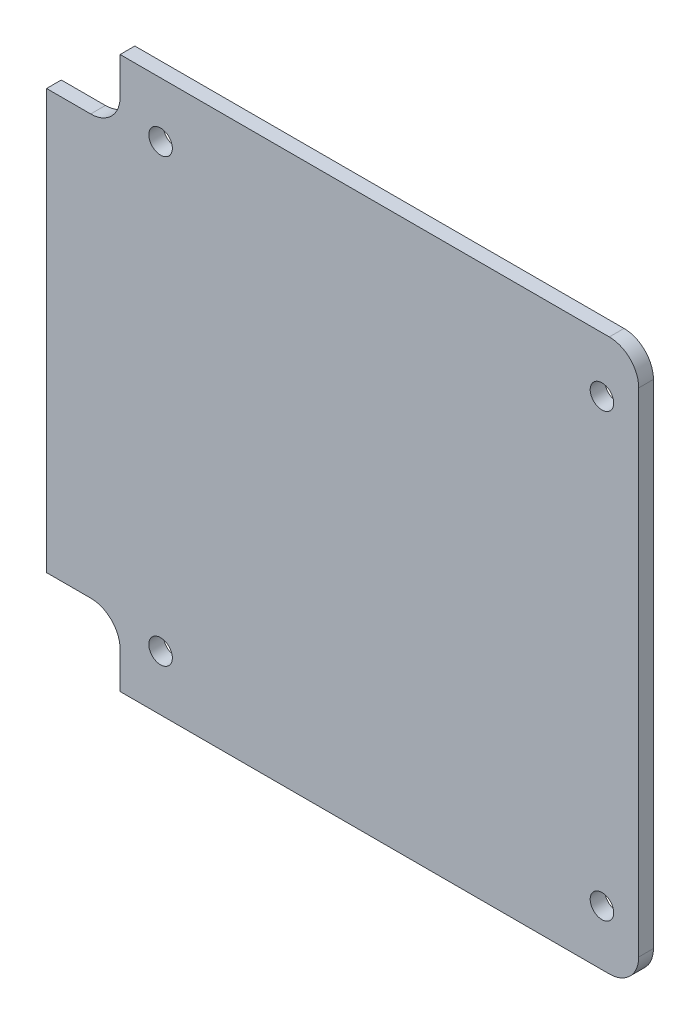
ISO-10303-21;
HEADER;
FILE_DESCRIPTION(('STEP AP214'),'2;1');
FILE_NAME('part.step','',(''),(''),'','','');
FILE_SCHEMA(('AUTOMOTIVE_DESIGN { 1 0 10303 214 1 1 1 1 }'));
ENDSEC;
DATA;
#1=APPLICATION_CONTEXT('core data for automotive mechanical design processes');
#2=APPLICATION_PROTOCOL_DEFINITION('international standard','automotive_design',2000,#1);
#3=PRODUCT_CONTEXT('',#1,'mechanical');
#4=PRODUCT('Part','Part','',(#3));
#5=PRODUCT_RELATED_PRODUCT_CATEGORY('part','',(#4));
#6=PRODUCT_DEFINITION_FORMATION('','',#4);
#7=PRODUCT_DEFINITION_CONTEXT('part definition',#1,'design');
#8=PRODUCT_DEFINITION('design','',#6,#7);
#9=PRODUCT_DEFINITION_SHAPE('','',#8);
#10=(LENGTH_UNIT() NAMED_UNIT(*) SI_UNIT(.MILLI.,.METRE.));
#11=(NAMED_UNIT(*) PLANE_ANGLE_UNIT() SI_UNIT($,.RADIAN.));
#12=(NAMED_UNIT(*) SI_UNIT($,.STERADIAN.) SOLID_ANGLE_UNIT());
#13=UNCERTAINTY_MEASURE_WITH_UNIT(LENGTH_MEASURE(1.E-05),#10,'distance_accuracy_value','');
#14=(GEOMETRIC_REPRESENTATION_CONTEXT(3) GLOBAL_UNCERTAINTY_ASSIGNED_CONTEXT((#13)) GLOBAL_UNIT_ASSIGNED_CONTEXT((#10,
#11,#12)) REPRESENTATION_CONTEXT('',''));
#15=CARTESIAN_POINT('',(0.,0.,0.));
#16=DIRECTION('',(0.,0.,1.));
#17=DIRECTION('',(1.,0.,0.));
#18=AXIS2_PLACEMENT_3D('',#15,#16,#17);
#19=CARTESIAN_POINT('',(-30.25,0.,2.));
#20=DIRECTION('',(-1.,0.,0.));
#21=DIRECTION('',(0.,0.,1.));
#22=AXIS2_PLACEMENT_3D('',#19,#20,#21);
#23=PLANE('',#22);
#24=DIRECTION('',(0.,1.,0.));
#25=VECTOR('',#24,1.);
#26=CARTESIAN_POINT('',(-30.25,0.,2.));
#27=LINE('',#26,#25);
#28=CARTESIAN_POINT('',(-30.25,-37.5,2.));
#29=VERTEX_POINT('',#28);
#30=CARTESIAN_POINT('',(-30.25,-32.5,2.));
#31=VERTEX_POINT('',#30);
#32=EDGE_CURVE('E127',#29,#31,#27,.T.);
#33=ORIENTED_EDGE('',*,*,#32,.T.);
#34=DIRECTION('',(0.,0.,-1.));
#35=VECTOR('',#34,1.);
#36=CARTESIAN_POINT('',(-30.25,-32.5,2.));
#37=LINE('',#36,#35);
#38=CARTESIAN_POINT('',(-30.25,-32.5,0.));
#39=VERTEX_POINT('',#38);
#40=EDGE_CURVE('E225',#31,#39,#37,.T.);
#41=ORIENTED_EDGE('',*,*,#40,.T.);
#42=DIRECTION('',(0.,1.,0.));
#43=VECTOR('',#42,1.);
#44=CARTESIAN_POINT('',(-30.25,0.,0.));
#45=LINE('',#44,#43);
#46=CARTESIAN_POINT('',(-30.25,-37.5,0.));
#47=VERTEX_POINT('',#46);
#48=EDGE_CURVE('E130',#47,#39,#45,.T.);
#49=ORIENTED_EDGE('',*,*,#48,.F.);
#50=DIRECTION('',(0.,0.,-1.));
#51=VECTOR('',#50,1.);
#52=CARTESIAN_POINT('',(-30.25,-37.5,2.));
#53=LINE('',#52,#51);
#54=EDGE_CURVE('E123',#29,#47,#53,.T.);
#55=ORIENTED_EDGE('',*,*,#54,.F.);
#56=EDGE_LOOP('',(#33,#41,#49,#55));
#57=FACE_BOUND('',#56,.T.);
#58=ADVANCED_FACE('F33',(#57),#23,.T.);
#59=CARTESIAN_POINT('',(0.,-37.5,2.));
#60=DIRECTION('',(0.,1.,0.));
#61=DIRECTION('',(0.,0.,1.));
#62=AXIS2_PLACEMENT_3D('',#59,#60,#61);
#63=PLANE('',#62);
#64=DIRECTION('',(1.,0.,0.));
#65=VECTOR('',#64,1.);
#66=CARTESIAN_POINT('',(0.,-37.5,0.));
#67=LINE('',#66,#65);
#68=CARTESIAN_POINT('',(36.25,-37.5,0.));
#69=VERTEX_POINT('',#68);
#70=EDGE_CURVE('E184',#47,#69,#67,.T.);
#71=ORIENTED_EDGE('',*,*,#70,.T.);
#72=DIRECTION('',(0.,0.,-1.));
#73=VECTOR('',#72,1.);
#74=CARTESIAN_POINT('',(36.25,-37.5,2.));
#75=LINE('',#74,#73);
#76=CARTESIAN_POINT('',(36.25,-37.5,2.));
#77=VERTEX_POINT('',#76);
#78=EDGE_CURVE('E141',#69,#77,#75,.F.);
#79=ORIENTED_EDGE('',*,*,#78,.T.);
#80=DIRECTION('',(1.,0.,0.));
#81=VECTOR('',#80,1.);
#82=CARTESIAN_POINT('',(0.,-37.5,2.));
#83=LINE('',#82,#81);
#84=EDGE_CURVE('E138',#29,#77,#83,.T.);
#85=ORIENTED_EDGE('',*,*,#84,.F.);
#86=ORIENTED_EDGE('',*,*,#54,.T.);
#87=EDGE_LOOP('',(#71,#79,#85,#86));
#88=FACE_BOUND('',#87,.T.);
#89=ADVANCED_FACE('F139',(#88),#63,.F.);
#90=CARTESIAN_POINT('',(40.25,0.,2.));
#91=DIRECTION('',(1.,0.,0.));
#92=DIRECTION('',(0.,1.,0.));
#93=AXIS2_PLACEMENT_3D('',#90,#91,#92);
#94=PLANE('',#93);
#95=DIRECTION('',(0.,-1.,0.));
#96=VECTOR('',#95,1.);
#97=CARTESIAN_POINT('',(40.25,0.,0.));
#98=LINE('',#97,#96);
#99=CARTESIAN_POINT('',(40.25,33.5,0.));
#100=VERTEX_POINT('',#99);
#101=CARTESIAN_POINT('',(40.25,-33.5,0.));
#102=VERTEX_POINT('',#101);
#103=EDGE_CURVE('E186',#100,#102,#98,.T.);
#104=ORIENTED_EDGE('',*,*,#103,.F.);
#105=DIRECTION('',(0.,0.,-1.));
#106=VECTOR('',#105,1.);
#107=CARTESIAN_POINT('',(40.25,33.5,2.));
#108=LINE('',#107,#106);
#109=CARTESIAN_POINT('',(40.25,33.5,2.));
#110=VERTEX_POINT('',#109);
#111=EDGE_CURVE('E218',#100,#110,#108,.F.);
#112=ORIENTED_EDGE('',*,*,#111,.T.);
#113=DIRECTION('',(0.,-1.,0.));
#114=VECTOR('',#113,1.);
#115=CARTESIAN_POINT('',(40.25,0.,2.));
#116=LINE('',#115,#114);
#117=CARTESIAN_POINT('',(40.25,-33.5,2.));
#118=VERTEX_POINT('',#117);
#119=EDGE_CURVE('E143',#110,#118,#116,.T.);
#120=ORIENTED_EDGE('',*,*,#119,.T.);
#121=DIRECTION('',(0.,0.,-1.));
#122=VECTOR('',#121,1.);
#123=CARTESIAN_POINT('',(40.25,-33.5,0.));
#124=LINE('',#123,#122);
#125=EDGE_CURVE('E215',#118,#102,#124,.T.);
#126=ORIENTED_EDGE('',*,*,#125,.T.);
#127=EDGE_LOOP('',(#104,#112,#120,#126));
#128=FACE_BOUND('',#127,.T.);
#129=ADVANCED_FACE('F262',(#128),#94,.T.);
#130=CARTESIAN_POINT('',(0.,37.5,2.));
#131=DIRECTION('',(0.,1.,0.));
#132=DIRECTION('',(0.,0.,1.));
#133=AXIS2_PLACEMENT_3D('',#130,#131,#132);
#134=PLANE('',#133);
#135=DIRECTION('',(1.,0.,0.));
#136=VECTOR('',#135,1.);
#137=CARTESIAN_POINT('',(0.,37.5,2.));
#138=LINE('',#137,#136);
#139=CARTESIAN_POINT('',(-30.25,37.5,2.));
#140=VERTEX_POINT('',#139);
#141=CARTESIAN_POINT('',(36.25,37.5,2.));
#142=VERTEX_POINT('',#141);
#143=EDGE_CURVE('E158',#140,#142,#138,.T.);
#144=ORIENTED_EDGE('',*,*,#143,.T.);
#145=DIRECTION('',(0.,0.,-1.));
#146=VECTOR('',#145,1.);
#147=CARTESIAN_POINT('',(36.25,37.5,2.));
#148=LINE('',#147,#146);
#149=CARTESIAN_POINT('',(36.25,37.5,0.));
#150=VERTEX_POINT('',#149);
#151=EDGE_CURVE('E134',#142,#150,#148,.T.);
#152=ORIENTED_EDGE('',*,*,#151,.T.);
#153=DIRECTION('',(1.,0.,0.));
#154=VECTOR('',#153,1.);
#155=CARTESIAN_POINT('',(0.,37.5,0.));
#156=LINE('',#155,#154);
#157=CARTESIAN_POINT('',(-30.25,37.5,0.));
#158=VERTEX_POINT('',#157);
#159=EDGE_CURVE('E189',#158,#150,#156,.T.);
#160=ORIENTED_EDGE('',*,*,#159,.F.);
#161=DIRECTION('',(0.,0.,-1.));
#162=VECTOR('',#161,1.);
#163=CARTESIAN_POINT('',(-30.25,37.5,2.));
#164=LINE('',#163,#162);
#165=EDGE_CURVE('E135',#140,#158,#164,.T.);
#166=ORIENTED_EDGE('',*,*,#165,.F.);
#167=EDGE_LOOP('',(#144,#152,#160,#166));
#168=FACE_BOUND('',#167,.T.);
#169=ADVANCED_FACE('F269',(#168),#134,.T.);
#170=CARTESIAN_POINT('',(-30.25,0.,2.));
#171=DIRECTION('',(1.,0.,0.));
#172=DIRECTION('',(0.,1.,0.));
#173=AXIS2_PLACEMENT_3D('',#170,#171,#172);
#174=PLANE('',#173);
#175=DIRECTION('',(0.,-1.,0.));
#176=VECTOR('',#175,1.);
#177=CARTESIAN_POINT('',(-30.25,0.,0.));
#178=LINE('',#177,#176);
#179=CARTESIAN_POINT('',(-30.25,32.5,0.));
#180=VERTEX_POINT('',#179);
#181=EDGE_CURVE('E192',#158,#180,#178,.T.);
#182=ORIENTED_EDGE('',*,*,#181,.T.);
#183=DIRECTION('',(0.,0.,-1.));
#184=VECTOR('',#183,1.);
#185=CARTESIAN_POINT('',(-30.25,32.5,2.));
#186=LINE('',#185,#184);
#187=CARTESIAN_POINT('',(-30.25,32.5,2.));
#188=VERTEX_POINT('',#187);
#189=EDGE_CURVE('E231',#180,#188,#186,.F.);
#190=ORIENTED_EDGE('',*,*,#189,.T.);
#191=DIRECTION('',(0.,-1.,0.));
#192=VECTOR('',#191,1.);
#193=CARTESIAN_POINT('',(-30.25,0.,2.));
#194=LINE('',#193,#192);
#195=EDGE_CURVE('E161',#140,#188,#194,.T.);
#196=ORIENTED_EDGE('',*,*,#195,.F.);
#197=ORIENTED_EDGE('',*,*,#165,.T.);
#198=EDGE_LOOP('',(#182,#190,#196,#197));
#199=FACE_BOUND('',#198,.T.);
#200=ADVANCED_FACE('F245',(#199),#174,.F.);
#201=CARTESIAN_POINT('',(0.,28.5,2.));
#202=DIRECTION('',(0.,1.,0.));
#203=DIRECTION('',(0.,0.,1.));
#204=AXIS2_PLACEMENT_3D('',#201,#202,#203);
#205=PLANE('',#204);
#206=DIRECTION('',(1.,0.,0.));
#207=VECTOR('',#206,1.);
#208=CARTESIAN_POINT('',(0.,28.5,2.));
#209=LINE('',#208,#207);
#210=CARTESIAN_POINT('',(-40.25,28.5,2.));
#211=VERTEX_POINT('',#210);
#212=CARTESIAN_POINT('',(-34.25,28.5,2.));
#213=VERTEX_POINT('',#212);
#214=EDGE_CURVE('E163',#211,#213,#209,.T.);
#215=ORIENTED_EDGE('',*,*,#214,.T.);
#216=DIRECTION('',(0.,0.,-1.));
#217=VECTOR('',#216,1.);
#218=CARTESIAN_POINT('',(-34.25,28.5,2.));
#219=LINE('',#218,#217);
#220=CARTESIAN_POINT('',(-34.25,28.5,0.));
#221=VERTEX_POINT('',#220);
#222=EDGE_CURVE('E228',#213,#221,#219,.T.);
#223=ORIENTED_EDGE('',*,*,#222,.T.);
#224=DIRECTION('',(1.,0.,0.));
#225=VECTOR('',#224,1.);
#226=CARTESIAN_POINT('',(0.,28.5,0.));
#227=LINE('',#226,#225);
#228=CARTESIAN_POINT('',(-40.25,28.5,0.));
#229=VERTEX_POINT('',#228);
#230=EDGE_CURVE('E195',#229,#221,#227,.T.);
#231=ORIENTED_EDGE('',*,*,#230,.F.);
#232=DIRECTION('',(0.,0.,-1.));
#233=VECTOR('',#232,1.);
#234=CARTESIAN_POINT('',(-40.25,28.5,2.));
#235=LINE('',#234,#233);
#236=EDGE_CURVE('E206',#211,#229,#235,.T.);
#237=ORIENTED_EDGE('',*,*,#236,.F.);
#238=EDGE_LOOP('',(#215,#223,#231,#237));
#239=FACE_BOUND('',#238,.T.);
#240=ADVANCED_FACE('F248',(#239),#205,.T.);
#241=CARTESIAN_POINT('',(-40.25,0.,2.));
#242=DIRECTION('',(1.,0.,0.));
#243=DIRECTION('',(0.,1.,0.));
#244=AXIS2_PLACEMENT_3D('',#241,#242,#243);
#245=PLANE('',#244);
#246=DIRECTION('',(0.,-1.,0.));
#247=VECTOR('',#246,1.);
#248=CARTESIAN_POINT('',(-40.25,0.,0.));
#249=LINE('',#248,#247);
#250=CARTESIAN_POINT('',(-40.25,-28.5,0.));
#251=VERTEX_POINT('',#250);
#252=EDGE_CURVE('E198',#229,#251,#249,.T.);
#253=ORIENTED_EDGE('',*,*,#252,.T.);
#254=DIRECTION('',(0.,0.,-1.));
#255=VECTOR('',#254,1.);
#256=CARTESIAN_POINT('',(-40.25,-28.5,2.));
#257=LINE('',#256,#255);
#258=CARTESIAN_POINT('',(-40.25,-28.5,2.));
#259=VERTEX_POINT('',#258);
#260=EDGE_CURVE('E170',#259,#251,#257,.T.);
#261=ORIENTED_EDGE('',*,*,#260,.F.);
#262=DIRECTION('',(0.,-1.,0.));
#263=VECTOR('',#262,1.);
#264=CARTESIAN_POINT('',(-40.25,0.,2.));
#265=LINE('',#264,#263);
#266=EDGE_CURVE('E165',#211,#259,#265,.T.);
#267=ORIENTED_EDGE('',*,*,#266,.F.);
#268=ORIENTED_EDGE('',*,*,#236,.T.);
#269=EDGE_LOOP('',(#253,#261,#267,#268));
#270=FACE_BOUND('',#269,.T.);
#271=ADVANCED_FACE('F252',(#270),#245,.F.);
#272=CARTESIAN_POINT('',(35.25,-30.,2.));
#273=DIRECTION('',(0.,0.,-1.));
#274=DIRECTION('',(-1.,0.,0.));
#275=AXIS2_PLACEMENT_3D('',#272,#273,#274);
#276=CYLINDRICAL_SURFACE('',#275,1.6);
#277=CARTESIAN_POINT('',(35.25,-30.,2.));
#278=DIRECTION('',(0.,0.,1.));
#279=DIRECTION('',(1.,0.,0.));
#280=AXIS2_PLACEMENT_3D('',#277,#278,#279);
#281=CIRCLE('',#280,1.6);
#282=CARTESIAN_POINT('',(36.85,-30.,2.));
#283=VERTEX_POINT('',#282);
#284=EDGE_CURVE('E149',#283,#283,#281,.T.);
#285=ORIENTED_EDGE('',*,*,#284,.T.);
#286=EDGE_LOOP('',(#285));
#287=FACE_BOUND('',#286,.T.);
#288=CARTESIAN_POINT('',(35.25,-30.,0.));
#289=DIRECTION('',(0.,0.,1.));
#290=DIRECTION('',(1.,0.,0.));
#291=AXIS2_PLACEMENT_3D('',#288,#289,#290);
#292=CIRCLE('',#291,1.6);
#293=CARTESIAN_POINT('',(36.85,-30.,0.));
#294=VERTEX_POINT('',#293);
#295=EDGE_CURVE('E180',#294,#294,#292,.T.);
#296=ORIENTED_EDGE('',*,*,#295,.F.);
#297=EDGE_LOOP('',(#296));
#298=FACE_BOUND('',#297,.T.);
#299=ADVANCED_FACE('F285',(#287,#298),#276,.F.);
#300=CARTESIAN_POINT('',(35.25,30.,2.));
#301=DIRECTION('',(0.,0.,-1.));
#302=DIRECTION('',(-1.,0.,0.));
#303=AXIS2_PLACEMENT_3D('',#300,#301,#302);
#304=CYLINDRICAL_SURFACE('',#303,1.6);
#305=CARTESIAN_POINT('',(35.25,30.,2.));
#306=DIRECTION('',(0.,0.,1.));
#307=DIRECTION('',(1.,0.,0.));
#308=AXIS2_PLACEMENT_3D('',#305,#306,#307);
#309=CIRCLE('',#308,1.6);
#310=CARTESIAN_POINT('',(36.85,30.,2.));
#311=VERTEX_POINT('',#310);
#312=EDGE_CURVE('E152',#311,#311,#309,.T.);
#313=ORIENTED_EDGE('',*,*,#312,.T.);
#314=EDGE_LOOP('',(#313));
#315=FACE_BOUND('',#314,.T.);
#316=CARTESIAN_POINT('',(35.25,30.,0.));
#317=DIRECTION('',(0.,0.,1.));
#318=DIRECTION('',(1.,0.,0.));
#319=AXIS2_PLACEMENT_3D('',#316,#317,#318);
#320=CIRCLE('',#319,1.6);
#321=CARTESIAN_POINT('',(36.85,30.,0.));
#322=VERTEX_POINT('',#321);
#323=EDGE_CURVE('E177',#322,#322,#320,.T.);
#324=ORIENTED_EDGE('',*,*,#323,.F.);
#325=EDGE_LOOP('',(#324));
#326=FACE_BOUND('',#325,.T.);
#327=ADVANCED_FACE('F288',(#315,#326),#304,.F.);
#328=CARTESIAN_POINT('',(-24.75,30.,2.));
#329=DIRECTION('',(0.,0.,-1.));
#330=DIRECTION('',(-1.,0.,0.));
#331=AXIS2_PLACEMENT_3D('',#328,#329,#330);
#332=CYLINDRICAL_SURFACE('',#331,1.6);
#333=CARTESIAN_POINT('',(-24.75,30.,2.));
#334=DIRECTION('',(0.,0.,1.));
#335=DIRECTION('',(1.,0.,0.));
#336=AXIS2_PLACEMENT_3D('',#333,#334,#335);
#337=CIRCLE('',#336,1.6);
#338=CARTESIAN_POINT('',(-23.15,30.,2.));
#339=VERTEX_POINT('',#338);
#340=EDGE_CURVE('E428',#339,#339,#337,.T.);
#341=ORIENTED_EDGE('',*,*,#340,.T.);
#342=EDGE_LOOP('',(#341));
#343=FACE_BOUND('',#342,.T.);
#344=CARTESIAN_POINT('',(-24.75,30.,0.));
#345=DIRECTION('',(0.,0.,1.));
#346=DIRECTION('',(1.,0.,0.));
#347=AXIS2_PLACEMENT_3D('',#344,#345,#346);
#348=CIRCLE('',#347,1.6);
#349=CARTESIAN_POINT('',(-23.15,30.,0.));
#350=VERTEX_POINT('',#349);
#351=EDGE_CURVE('E174',#350,#350,#348,.T.);
#352=ORIENTED_EDGE('',*,*,#351,.F.);
#353=EDGE_LOOP('',(#352));
#354=FACE_BOUND('',#353,.T.);
#355=ADVANCED_FACE('F292',(#343,#354),#332,.F.);
#356=CARTESIAN_POINT('',(-24.75,-30.,2.));
#357=DIRECTION('',(0.,0.,-1.));
#358=DIRECTION('',(-1.,0.,0.));
#359=AXIS2_PLACEMENT_3D('',#356,#357,#358);
#360=CYLINDRICAL_SURFACE('',#359,1.6);
#361=CARTESIAN_POINT('',(-24.75,-30.,2.));
#362=DIRECTION('',(0.,0.,1.));
#363=DIRECTION('',(1.,0.,0.));
#364=AXIS2_PLACEMENT_3D('',#361,#362,#363);
#365=CIRCLE('',#364,1.6);
#366=CARTESIAN_POINT('',(-23.15,-30.,2.));
#367=VERTEX_POINT('',#366);
#368=EDGE_CURVE('E203',#367,#367,#365,.T.);
#369=ORIENTED_EDGE('',*,*,#368,.T.);
#370=EDGE_LOOP('',(#369));
#371=FACE_BOUND('',#370,.T.);
#372=CARTESIAN_POINT('',(-24.75,-30.,0.));
#373=DIRECTION('',(0.,0.,1.));
#374=DIRECTION('',(1.,0.,0.));
#375=AXIS2_PLACEMENT_3D('',#372,#373,#374);
#376=CIRCLE('',#375,1.6);
#377=CARTESIAN_POINT('',(-23.15,-30.,0.));
#378=VERTEX_POINT('',#377);
#379=EDGE_CURVE('E171',#378,#378,#376,.T.);
#380=ORIENTED_EDGE('',*,*,#379,.F.);
#381=EDGE_LOOP('',(#380));
#382=FACE_BOUND('',#381,.T.);
#383=ADVANCED_FACE('F296',(#371,#382),#360,.F.);
#384=CARTESIAN_POINT('',(0.,-28.5,2.));
#385=DIRECTION('',(0.,1.,0.));
#386=DIRECTION('',(0.,0.,1.));
#387=AXIS2_PLACEMENT_3D('',#384,#385,#386);
#388=PLANE('',#387);
#389=DIRECTION('',(1.,0.,0.));
#390=VECTOR('',#389,1.);
#391=CARTESIAN_POINT('',(0.,-28.5,0.));
#392=LINE('',#391,#390);
#393=CARTESIAN_POINT('',(-34.25,-28.5,0.));
#394=VERTEX_POINT('',#393);
#395=EDGE_CURVE('E201',#251,#394,#392,.T.);
#396=ORIENTED_EDGE('',*,*,#395,.T.);
#397=DIRECTION('',(0.,0.,-1.));
#398=VECTOR('',#397,1.);
#399=CARTESIAN_POINT('',(-34.25,-28.5,2.));
#400=LINE('',#399,#398);
#401=CARTESIAN_POINT('',(-34.25,-28.5,2.));
#402=VERTEX_POINT('',#401);
#403=EDGE_CURVE('E48',#394,#402,#400,.F.);
#404=ORIENTED_EDGE('',*,*,#403,.T.);
#405=DIRECTION('',(1.,0.,0.));
#406=VECTOR('',#405,1.);
#407=CARTESIAN_POINT('',(0.,-28.5,2.));
#408=LINE('',#407,#406);
#409=EDGE_CURVE('E168',#259,#402,#408,.T.);
#410=ORIENTED_EDGE('',*,*,#409,.F.);
#411=ORIENTED_EDGE('',*,*,#260,.T.);
#412=EDGE_LOOP('',(#396,#404,#410,#411));
#413=FACE_BOUND('',#412,.T.);
#414=ADVANCED_FACE('F253',(#413),#388,.F.);
#415=CARTESIAN_POINT('',(0.,0.,2.));
#416=DIRECTION('',(0.,0.,1.));
#417=DIRECTION('',(1.,0.,0.));
#418=AXIS2_PLACEMENT_3D('',#415,#416,#417);
#419=PLANE('',#418);
#420=ORIENTED_EDGE('',*,*,#368,.F.);
#421=EDGE_LOOP('',(#420));
#422=FACE_BOUND('',#421,.T.);
#423=ORIENTED_EDGE('',*,*,#340,.F.);
#424=EDGE_LOOP('',(#423));
#425=FACE_BOUND('',#424,.T.);
#426=ORIENTED_EDGE('',*,*,#312,.F.);
#427=EDGE_LOOP('',(#426));
#428=FACE_BOUND('',#427,.T.);
#429=ORIENTED_EDGE('',*,*,#284,.F.);
#430=EDGE_LOOP('',(#429));
#431=FACE_BOUND('',#430,.T.);
#432=ORIENTED_EDGE('',*,*,#119,.F.);
#433=CARTESIAN_POINT('',(36.25,33.5,2.));
#434=DIRECTION('',(0.,0.,1.));
#435=DIRECTION('',(1.,0.,0.));
#436=AXIS2_PLACEMENT_3D('',#433,#434,#435);
#437=CIRCLE('',#436,4.);
#438=EDGE_CURVE('E222',#110,#142,#437,.T.);
#439=ORIENTED_EDGE('',*,*,#438,.T.);
#440=ORIENTED_EDGE('',*,*,#143,.F.);
#441=ORIENTED_EDGE('',*,*,#195,.T.);
#442=CARTESIAN_POINT('',(-34.25,32.5,2.));
#443=DIRECTION('',(0.,0.,1.));
#444=DIRECTION('',(1.,0.,0.));
#445=AXIS2_PLACEMENT_3D('',#442,#443,#444);
#446=CIRCLE('',#445,4.);
#447=EDGE_CURVE('E11',#188,#213,#446,.F.);
#448=ORIENTED_EDGE('',*,*,#447,.T.);
#449=ORIENTED_EDGE('',*,*,#214,.F.);
#450=ORIENTED_EDGE('',*,*,#266,.T.);
#451=ORIENTED_EDGE('',*,*,#409,.T.);
#452=CARTESIAN_POINT('',(-34.25,-32.5,2.));
#453=DIRECTION('',(0.,0.,1.));
#454=DIRECTION('',(1.,0.,0.));
#455=AXIS2_PLACEMENT_3D('',#452,#453,#454);
#456=CIRCLE('',#455,4.);
#457=EDGE_CURVE('E148',#402,#31,#456,.F.);
#458=ORIENTED_EDGE('',*,*,#457,.T.);
#459=ORIENTED_EDGE('',*,*,#32,.F.);
#460=ORIENTED_EDGE('',*,*,#84,.T.);
#461=CARTESIAN_POINT('',(36.25,-33.5,2.));
#462=DIRECTION('',(0.,0.,1.));
#463=DIRECTION('',(1.,0.,0.));
#464=AXIS2_PLACEMENT_3D('',#461,#462,#463);
#465=CIRCLE('',#464,4.);
#466=EDGE_CURVE('E220',#77,#118,#465,.T.);
#467=ORIENTED_EDGE('',*,*,#466,.T.);
#468=EDGE_LOOP('',(#432,#439,#440,#441,#448,#449,#450,#451,#458,#459,#460,#467));
#469=FACE_BOUND('',#468,.T.);
#470=ADVANCED_FACE('F146',(#422,#425,#428,#431,#469),#419,.T.);
#471=CARTESIAN_POINT('',(0.,0.,0.));
#472=DIRECTION('',(0.,0.,1.));
#473=DIRECTION('',(1.,0.,0.));
#474=AXIS2_PLACEMENT_3D('',#471,#472,#473);
#475=PLANE('',#474);
#476=ORIENTED_EDGE('',*,*,#379,.T.);
#477=EDGE_LOOP('',(#476));
#478=FACE_BOUND('',#477,.T.);
#479=ORIENTED_EDGE('',*,*,#351,.T.);
#480=EDGE_LOOP('',(#479));
#481=FACE_BOUND('',#480,.T.);
#482=ORIENTED_EDGE('',*,*,#323,.T.);
#483=EDGE_LOOP('',(#482));
#484=FACE_BOUND('',#483,.T.);
#485=ORIENTED_EDGE('',*,*,#295,.T.);
#486=EDGE_LOOP('',(#485));
#487=FACE_BOUND('',#486,.T.);
#488=ORIENTED_EDGE('',*,*,#159,.T.);
#489=CARTESIAN_POINT('',(36.25,33.5,0.));
#490=DIRECTION('',(0.,0.,1.));
#491=DIRECTION('',(1.,0.,0.));
#492=AXIS2_PLACEMENT_3D('',#489,#490,#491);
#493=CIRCLE('',#492,4.);
#494=EDGE_CURVE('E213',#150,#100,#493,.F.);
#495=ORIENTED_EDGE('',*,*,#494,.T.);
#496=ORIENTED_EDGE('',*,*,#103,.T.);
#497=CARTESIAN_POINT('',(36.25,-33.5,0.));
#498=DIRECTION('',(0.,0.,1.));
#499=DIRECTION('',(1.,0.,0.));
#500=AXIS2_PLACEMENT_3D('',#497,#498,#499);
#501=CIRCLE('',#500,4.);
#502=EDGE_CURVE('E211',#102,#69,#501,.F.);
#503=ORIENTED_EDGE('',*,*,#502,.T.);
#504=ORIENTED_EDGE('',*,*,#70,.F.);
#505=ORIENTED_EDGE('',*,*,#48,.T.);
#506=CARTESIAN_POINT('',(-34.25,-32.5,0.));
#507=DIRECTION('',(0.,0.,1.));
#508=DIRECTION('',(1.,0.,0.));
#509=AXIS2_PLACEMENT_3D('',#506,#507,#508);
#510=CIRCLE('',#509,4.);
#511=EDGE_CURVE('E233',#39,#394,#510,.T.);
#512=ORIENTED_EDGE('',*,*,#511,.T.);
#513=ORIENTED_EDGE('',*,*,#395,.F.);
#514=ORIENTED_EDGE('',*,*,#252,.F.);
#515=ORIENTED_EDGE('',*,*,#230,.T.);
#516=CARTESIAN_POINT('',(-34.25,32.5,0.));
#517=DIRECTION('',(0.,0.,1.));
#518=DIRECTION('',(1.,0.,0.));
#519=AXIS2_PLACEMENT_3D('',#516,#517,#518);
#520=CIRCLE('',#519,4.);
#521=EDGE_CURVE('E41',#221,#180,#520,.T.);
#522=ORIENTED_EDGE('',*,*,#521,.T.);
#523=ORIENTED_EDGE('',*,*,#181,.F.);
#524=EDGE_LOOP('',(#488,#495,#496,#503,#504,#505,#512,#513,#514,#515,#522,#523));
#525=FACE_BOUND('',#524,.T.);
#526=ADVANCED_FACE('F237',(#478,#481,#484,#487,#525),#475,.F.);
#527=CARTESIAN_POINT('',(36.25,33.5,2.));
#528=DIRECTION('',(0.,0.,-1.));
#529=DIRECTION('',(-1.,0.,0.));
#530=AXIS2_PLACEMENT_3D('',#527,#528,#529);
#531=CYLINDRICAL_SURFACE('',#530,4.);
#532=ORIENTED_EDGE('',*,*,#438,.F.);
#533=ORIENTED_EDGE('',*,*,#111,.F.);
#534=ORIENTED_EDGE('',*,*,#494,.F.);
#535=ORIENTED_EDGE('',*,*,#151,.F.);
#536=EDGE_LOOP('',(#532,#533,#534,#535));
#537=FACE_BOUND('',#536,.T.);
#538=ADVANCED_FACE('F265',(#537),#531,.T.);
#539=CARTESIAN_POINT('',(36.25,-33.5,2.));
#540=DIRECTION('',(0.,0.,1.));
#541=DIRECTION('',(1.,0.,0.));
#542=AXIS2_PLACEMENT_3D('',#539,#540,#541);
#543=CYLINDRICAL_SURFACE('',#542,4.);
#544=ORIENTED_EDGE('',*,*,#466,.F.);
#545=ORIENTED_EDGE('',*,*,#78,.F.);
#546=ORIENTED_EDGE('',*,*,#502,.F.);
#547=ORIENTED_EDGE('',*,*,#125,.F.);
#548=EDGE_LOOP('',(#544,#545,#546,#547));
#549=FACE_BOUND('',#548,.T.);
#550=ADVANCED_FACE('F257',(#549),#543,.T.);
#551=CARTESIAN_POINT('',(-34.25,-32.5,2.));
#552=DIRECTION('',(0.,0.,-1.));
#553=DIRECTION('',(-1.,0.,0.));
#554=AXIS2_PLACEMENT_3D('',#551,#552,#553);
#555=CYLINDRICAL_SURFACE('',#554,4.);
#556=ORIENTED_EDGE('',*,*,#457,.F.);
#557=ORIENTED_EDGE('',*,*,#403,.F.);
#558=ORIENTED_EDGE('',*,*,#511,.F.);
#559=ORIENTED_EDGE('',*,*,#40,.F.);
#560=EDGE_LOOP('',(#556,#557,#558,#559));
#561=FACE_BOUND('',#560,.T.);
#562=ADVANCED_FACE('F255',(#561),#555,.F.);
#563=CARTESIAN_POINT('',(-34.25,32.5,2.));
#564=DIRECTION('',(0.,0.,-1.));
#565=DIRECTION('',(-1.,0.,0.));
#566=AXIS2_PLACEMENT_3D('',#563,#564,#565);
#567=CYLINDRICAL_SURFACE('',#566,4.);
#568=ORIENTED_EDGE('',*,*,#447,.F.);
#569=ORIENTED_EDGE('',*,*,#189,.F.);
#570=ORIENTED_EDGE('',*,*,#521,.F.);
#571=ORIENTED_EDGE('',*,*,#222,.F.);
#572=EDGE_LOOP('',(#568,#569,#570,#571));
#573=FACE_BOUND('',#572,.T.);
#574=ADVANCED_FACE('F35',(#573),#567,.F.);
#575=CLOSED_SHELL('',(#58,#89,#129,#169,#200,#240,#271,#299,#327,#355,#383,#414,#470,#526,#538,
#550,#562,#574));
#576=MANIFOLD_SOLID_BREP('B2',#575);
#577=ADVANCED_BREP_SHAPE_REPRESENTATION('',(#18,#576),#14);
#578=SHAPE_DEFINITION_REPRESENTATION(#9,#577);
ENDSEC;
END-ISO-10303-21;
